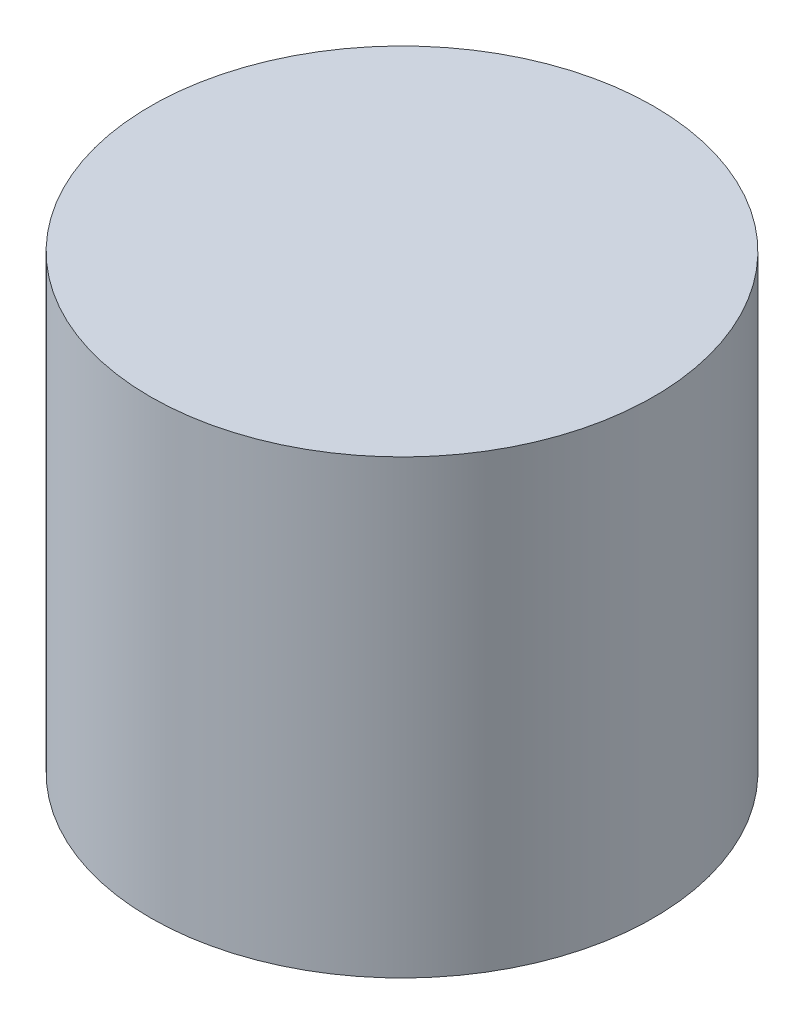
ISO-10303-21;
HEADER;
FILE_DESCRIPTION(('STEP AP214'),'2;1');
FILE_NAME('part.step','',(''),(''),'','','');
FILE_SCHEMA(('AUTOMOTIVE_DESIGN { 1 0 10303 214 1 1 1 1 }'));
ENDSEC;
DATA;
#1=APPLICATION_CONTEXT('core data for automotive mechanical design processes');
#2=APPLICATION_PROTOCOL_DEFINITION('international standard','automotive_design',2000,#1);
#3=PRODUCT_CONTEXT('',#1,'mechanical');
#4=PRODUCT('Part','Part','',(#3));
#5=PRODUCT_RELATED_PRODUCT_CATEGORY('part','',(#4));
#6=PRODUCT_DEFINITION_FORMATION('','',#4);
#7=PRODUCT_DEFINITION_CONTEXT('part definition',#1,'design');
#8=PRODUCT_DEFINITION('design','',#6,#7);
#9=PRODUCT_DEFINITION_SHAPE('','',#8);
#10=(LENGTH_UNIT() NAMED_UNIT(*) SI_UNIT(.MILLI.,.METRE.));
#11=(NAMED_UNIT(*) PLANE_ANGLE_UNIT() SI_UNIT($,.RADIAN.));
#12=(NAMED_UNIT(*) SI_UNIT($,.STERADIAN.) SOLID_ANGLE_UNIT());
#13=UNCERTAINTY_MEASURE_WITH_UNIT(LENGTH_MEASURE(1.E-05),#10,'distance_accuracy_value','');
#14=(GEOMETRIC_REPRESENTATION_CONTEXT(3) GLOBAL_UNCERTAINTY_ASSIGNED_CONTEXT((#13)) GLOBAL_UNIT_ASSIGNED_CONTEXT((#10,
#11,#12)) REPRESENTATION_CONTEXT('',''));
#15=CARTESIAN_POINT('',(0.,0.,0.));
#16=DIRECTION('',(0.,0.,1.));
#17=DIRECTION('',(1.,0.,0.));
#18=AXIS2_PLACEMENT_3D('',#15,#16,#17);
#19=CARTESIAN_POINT('',(0.,13.,0.));
#20=DIRECTION('',(0.,-1.,0.));
#21=DIRECTION('',(0.,0.,-1.));
#22=AXIS2_PLACEMENT_3D('',#19,#20,#21);
#23=CYLINDRICAL_SURFACE('',#22,7.25);
#24=CARTESIAN_POINT('',(0.,13.,0.));
#25=DIRECTION('',(0.,1.,0.));
#26=DIRECTION('',(0.,0.,1.));
#27=AXIS2_PLACEMENT_3D('',#24,#25,#26);
#28=CIRCLE('',#27,7.25);
#29=CARTESIAN_POINT('',(0.,13.,7.25));
#30=VERTEX_POINT('',#29);
#31=EDGE_CURVE('E10',#30,#30,#28,.T.);
#32=ORIENTED_EDGE('',*,*,#31,.F.);
#33=EDGE_LOOP('',(#32));
#34=FACE_BOUND('',#33,.T.);
#35=CARTESIAN_POINT('',(0.,0.,0.));
#36=DIRECTION('',(0.,1.,0.));
#37=DIRECTION('',(0.,0.,1.));
#38=AXIS2_PLACEMENT_3D('',#35,#36,#37);
#39=CIRCLE('',#38,7.25);
#40=CARTESIAN_POINT('',(0.,0.,7.25));
#41=VERTEX_POINT('',#40);
#42=EDGE_CURVE('E42',#41,#41,#39,.T.);
#43=ORIENTED_EDGE('',*,*,#42,.T.);
#44=EDGE_LOOP('',(#43));
#45=FACE_BOUND('',#44,.T.);
#46=ADVANCED_FACE('F39',(#34,#45),#23,.T.);
#47=CARTESIAN_POINT('',(0.,13.,0.));
#48=DIRECTION('',(0.,1.,0.));
#49=DIRECTION('',(0.,0.,1.));
#50=AXIS2_PLACEMENT_3D('',#47,#48,#49);
#51=PLANE('',#50);
#52=ORIENTED_EDGE('',*,*,#31,.T.);
#53=EDGE_LOOP('',(#52));
#54=FACE_BOUND('',#53,.T.);
#55=ADVANCED_FACE('F72',(#54),#51,.T.);
#56=CARTESIAN_POINT('',(0.,0.,0.));
#57=DIRECTION('',(0.,1.,0.));
#58=DIRECTION('',(0.,0.,1.));
#59=AXIS2_PLACEMENT_3D('',#56,#57,#58);
#60=PLANE('',#59);
#61=CARTESIAN_POINT('',(0.,0.,0.));
#62=DIRECTION('',(0.,-1.,0.));
#63=DIRECTION('',(0.,0.,-1.));
#64=AXIS2_PLACEMENT_3D('',#61,#62,#63);
#65=CIRCLE('',#64,5.25);
#66=CARTESIAN_POINT('',(0.,0.,-5.25));
#67=VERTEX_POINT('',#66);
#68=EDGE_CURVE('E53',#67,#67,#65,.T.);
#69=ORIENTED_EDGE('',*,*,#68,.F.);
#70=EDGE_LOOP('',(#69));
#71=FACE_BOUND('',#70,.T.);
#72=ORIENTED_EDGE('',*,*,#42,.F.);
#73=EDGE_LOOP('',(#72));
#74=FACE_BOUND('',#73,.T.);
#75=ADVANCED_FACE('F66',(#71,#74),#60,.F.);
#76=CARTESIAN_POINT('',(0.,11.,0.));
#77=DIRECTION('',(0.,-1.,0.));
#78=DIRECTION('',(0.,0.,-1.));
#79=AXIS2_PLACEMENT_3D('',#76,#77,#78);
#80=CYLINDRICAL_SURFACE('',#79,5.25);
#81=CARTESIAN_POINT('',(0.,11.,0.));
#82=DIRECTION('',(0.,-1.,0.));
#83=DIRECTION('',(0.,0.,-1.));
#84=AXIS2_PLACEMENT_3D('',#81,#82,#83);
#85=CIRCLE('',#84,5.25);
#86=CARTESIAN_POINT('',(0.,11.,-5.25));
#87=VERTEX_POINT('',#86);
#88=EDGE_CURVE('E51',#87,#87,#85,.T.);
#89=ORIENTED_EDGE('',*,*,#88,.F.);
#90=EDGE_LOOP('',(#89));
#91=FACE_BOUND('',#90,.T.);
#92=ORIENTED_EDGE('',*,*,#68,.T.);
#93=EDGE_LOOP('',(#92));
#94=FACE_BOUND('',#93,.T.);
#95=ADVANCED_FACE('F63',(#91,#94),#80,.F.);
#96=CARTESIAN_POINT('',(0.,11.,0.));
#97=DIRECTION('',(0.,-1.,0.));
#98=DIRECTION('',(0.,0.,-1.));
#99=AXIS2_PLACEMENT_3D('',#96,#97,#98);
#100=PLANE('',#99);
#101=ORIENTED_EDGE('',*,*,#88,.T.);
#102=EDGE_LOOP('',(#101));
#103=FACE_BOUND('',#102,.T.);
#104=ADVANCED_FACE('F61',(#103),#100,.T.);
#105=CLOSED_SHELL('',(#46,#55,#75,#95,#104));
#106=MANIFOLD_SOLID_BREP('B2',#105);
#107=ADVANCED_BREP_SHAPE_REPRESENTATION('',(#18,#106),#14);
#108=SHAPE_DEFINITION_REPRESENTATION(#9,#107);
ENDSEC;
END-ISO-10303-21;
